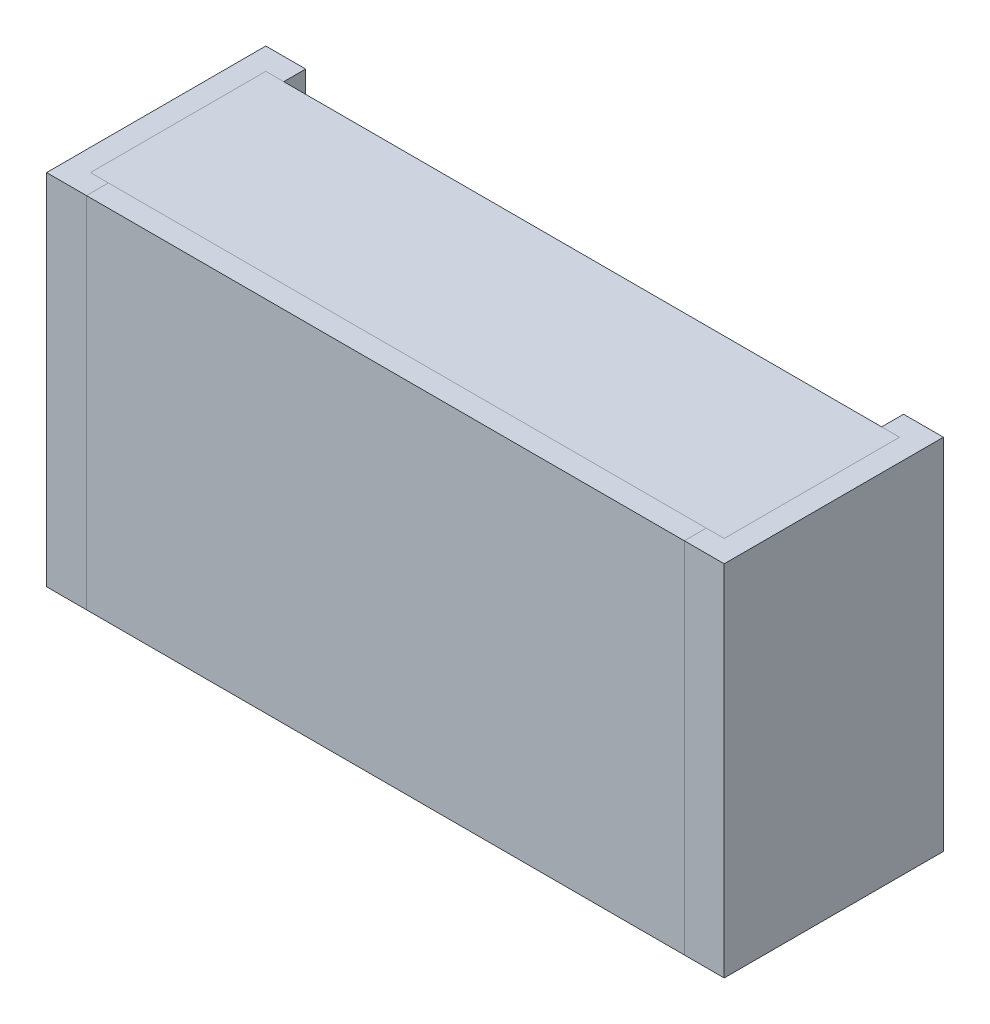
ISO-10303-21;
HEADER;
FILE_DESCRIPTION(('STEP AP214'),'2;1');
FILE_NAME('part.step','',(''),(''),'','','');
FILE_SCHEMA(('AUTOMOTIVE_DESIGN { 1 0 10303 214 1 1 1 1 }'));
ENDSEC;
DATA;
#1=APPLICATION_CONTEXT('core data for automotive mechanical design processes');
#2=APPLICATION_PROTOCOL_DEFINITION('international standard','automotive_design',2000,#1);
#3=PRODUCT_CONTEXT('',#1,'mechanical');
#4=PRODUCT('Part','Part','',(#3));
#5=PRODUCT_RELATED_PRODUCT_CATEGORY('part','',(#4));
#6=PRODUCT_DEFINITION_FORMATION('','',#4);
#7=PRODUCT_DEFINITION_CONTEXT('part definition',#1,'design');
#8=PRODUCT_DEFINITION('design','',#6,#7);
#9=PRODUCT_DEFINITION_SHAPE('','',#8);
#10=(LENGTH_UNIT() NAMED_UNIT(*) SI_UNIT(.MILLI.,.METRE.));
#11=(NAMED_UNIT(*) PLANE_ANGLE_UNIT() SI_UNIT($,.RADIAN.));
#12=(NAMED_UNIT(*) SI_UNIT($,.STERADIAN.) SOLID_ANGLE_UNIT());
#13=UNCERTAINTY_MEASURE_WITH_UNIT(LENGTH_MEASURE(1.E-05),#10,'distance_accuracy_value','');
#14=(GEOMETRIC_REPRESENTATION_CONTEXT(3) GLOBAL_UNCERTAINTY_ASSIGNED_CONTEXT((#13)) GLOBAL_UNIT_ASSIGNED_CONTEXT((#10,
#11,#12)) REPRESENTATION_CONTEXT('',''));
#15=CARTESIAN_POINT('',(0.,0.,0.));
#16=DIRECTION('',(0.,0.,1.));
#17=DIRECTION('',(1.,0.,0.));
#18=AXIS2_PLACEMENT_3D('',#15,#16,#17);
#19=CARTESIAN_POINT('',(-0.79491872,-0.44991872,0.055));
#20=DIRECTION('',(1.,0.,0.));
#21=DIRECTION('',(0.,0.,1.));
#22=AXIS2_PLACEMENT_3D('',#19,#20,#21);
#23=PLANE('',#22);
#24=DIRECTION('',(0.,1.,0.));
#25=VECTOR('',#24,1.);
#26=CARTESIAN_POINT('',(-0.79491872,-0.44991872,0.495));
#27=LINE('',#26,#25);
#28=CARTESIAN_POINT('',(-0.79491872,-0.44991872,0.495));
#29=VERTEX_POINT('',#28);
#30=CARTESIAN_POINT('',(-0.79491872,0.45008128,0.495));
#31=VERTEX_POINT('',#30);
#32=EDGE_CURVE('P0_E11',#29,#31,#27,.T.);
#33=ORIENTED_EDGE('',*,*,#32,.T.);
#34=DIRECTION('',(0.,0.,1.));
#35=VECTOR('',#34,1.);
#36=CARTESIAN_POINT('',(-0.79491872,0.45008128,0.055));
#37=LINE('',#36,#35);
#38=CARTESIAN_POINT('',(-0.79491872,0.45008128,0.055));
#39=VERTEX_POINT('',#38);
#40=EDGE_CURVE('P0_E24',#39,#31,#37,.T.);
#41=ORIENTED_EDGE('',*,*,#40,.F.);
#42=DIRECTION('',(0.,1.,0.));
#43=VECTOR('',#42,1.);
#44=CARTESIAN_POINT('',(-0.79491872,-0.44991872,0.055));
#45=LINE('',#44,#43);
#46=CARTESIAN_POINT('',(-0.79491872,-0.44991872,0.055));
#47=VERTEX_POINT('',#46);
#48=EDGE_CURVE('P0_E86',#47,#39,#45,.T.);
#49=ORIENTED_EDGE('',*,*,#48,.F.);
#50=DIRECTION('',(0.,0.,1.));
#51=VECTOR('',#50,1.);
#52=CARTESIAN_POINT('',(-0.79491872,-0.44991872,0.055));
#53=LINE('',#52,#51);
#54=EDGE_CURVE('P0_E36',#47,#29,#53,.T.);
#55=ORIENTED_EDGE('',*,*,#54,.T.);
#56=EDGE_LOOP('',(#33,#41,#49,#55));
#57=FACE_BOUND('',#56,.T.);
#58=ADVANCED_FACE('P0_F17',(#57),#23,.F.);
#59=CARTESIAN_POINT('',(0.79508128,-0.44991872,0.055));
#60=DIRECTION('',(1.,0.,0.));
#61=DIRECTION('',(0.,0.,1.));
#62=AXIS2_PLACEMENT_3D('',#59,#60,#61);
#63=PLANE('',#62);
#64=DIRECTION('',(0.,0.,1.));
#65=VECTOR('',#64,1.);
#66=CARTESIAN_POINT('',(0.79508128,-0.44991872,0.055));
#67=LINE('',#66,#65);
#68=CARTESIAN_POINT('',(0.79508128,-0.44991872,0.055));
#69=VERTEX_POINT('',#68);
#70=CARTESIAN_POINT('',(0.79508128,-0.44991872,0.495));
#71=VERTEX_POINT('',#70);
#72=EDGE_CURVE('P0_E83',#69,#71,#67,.T.);
#73=ORIENTED_EDGE('',*,*,#72,.F.);
#74=DIRECTION('',(0.,1.,0.));
#75=VECTOR('',#74,1.);
#76=CARTESIAN_POINT('',(0.79508128,-0.44991872,0.055));
#77=LINE('',#76,#75);
#78=CARTESIAN_POINT('',(0.79508128,0.45008128,0.055));
#79=VERTEX_POINT('',#78);
#80=EDGE_CURVE('P0_E63',#69,#79,#77,.T.);
#81=ORIENTED_EDGE('',*,*,#80,.T.);
#82=DIRECTION('',(0.,0.,1.));
#83=VECTOR('',#82,1.);
#84=CARTESIAN_POINT('',(0.79508128,0.45008128,0.055));
#85=LINE('',#84,#83);
#86=CARTESIAN_POINT('',(0.79508128,0.45008128,0.495));
#87=VERTEX_POINT('',#86);
#88=EDGE_CURVE('P0_E57',#79,#87,#85,.T.);
#89=ORIENTED_EDGE('',*,*,#88,.T.);
#90=DIRECTION('',(0.,1.,0.));
#91=VECTOR('',#90,1.);
#92=CARTESIAN_POINT('',(0.79508128,-0.44991872,0.495));
#93=LINE('',#92,#91);
#94=EDGE_CURVE('P0_E60',#71,#87,#93,.T.);
#95=ORIENTED_EDGE('',*,*,#94,.F.);
#96=EDGE_LOOP('',(#73,#81,#89,#95));
#97=FACE_BOUND('',#96,.T.);
#98=ADVANCED_FACE('P0_F59',(#97),#63,.T.);
#99=CARTESIAN_POINT('',(-0.79491872,-0.44991872,0.055));
#100=DIRECTION('',(0.,1.,0.));
#101=DIRECTION('',(0.,0.,1.));
#102=AXIS2_PLACEMENT_3D('',#99,#100,#101);
#103=PLANE('',#102);
#104=ORIENTED_EDGE('',*,*,#72,.T.);
#105=DIRECTION('',(1.,0.,0.));
#106=VECTOR('',#105,1.);
#107=CARTESIAN_POINT('',(-0.79491872,-0.44991872,0.495));
#108=LINE('',#107,#106);
#109=EDGE_CURVE('P0_E71',#29,#71,#108,.T.);
#110=ORIENTED_EDGE('',*,*,#109,.F.);
#111=ORIENTED_EDGE('',*,*,#54,.F.);
#112=DIRECTION('',(1.,0.,0.));
#113=VECTOR('',#112,1.);
#114=CARTESIAN_POINT('',(-0.79491872,-0.44991872,0.055));
#115=LINE('',#114,#113);
#116=EDGE_CURVE('P0_E76',#47,#69,#115,.T.);
#117=ORIENTED_EDGE('',*,*,#116,.T.);
#118=EDGE_LOOP('',(#104,#110,#111,#117));
#119=FACE_BOUND('',#118,.T.);
#120=ADVANCED_FACE('P0_F91',(#119),#103,.F.);
#121=CARTESIAN_POINT('',(-0.79491872,0.45008128,0.055));
#122=DIRECTION('',(0.,1.,0.));
#123=DIRECTION('',(0.,0.,1.));
#124=AXIS2_PLACEMENT_3D('',#121,#122,#123);
#125=PLANE('',#124);
#126=DIRECTION('',(1.,0.,0.));
#127=VECTOR('',#126,1.);
#128=CARTESIAN_POINT('',(-0.79491872,0.45008128,0.055));
#129=LINE('',#128,#127);
#130=EDGE_CURVE('P0_E74',#39,#79,#129,.T.);
#131=ORIENTED_EDGE('',*,*,#130,.F.);
#132=ORIENTED_EDGE('',*,*,#40,.T.);
#133=DIRECTION('',(1.,0.,0.));
#134=VECTOR('',#133,1.);
#135=CARTESIAN_POINT('',(-0.79491872,0.45008128,0.495));
#136=LINE('',#135,#134);
#137=EDGE_CURVE('P0_E69',#31,#87,#136,.T.);
#138=ORIENTED_EDGE('',*,*,#137,.T.);
#139=ORIENTED_EDGE('',*,*,#88,.F.);
#140=EDGE_LOOP('',(#131,#132,#138,#139));
#141=FACE_BOUND('',#140,.T.);
#142=ADVANCED_FACE('P0_F73',(#141),#125,.T.);
#143=CARTESIAN_POINT('',(-0.79491872,-0.44991872,0.055));
#144=DIRECTION('',(0.,0.,1.));
#145=DIRECTION('',(1.,0.,0.));
#146=AXIS2_PLACEMENT_3D('',#143,#144,#145);
#147=PLANE('',#146);
#148=ORIENTED_EDGE('',*,*,#130,.T.);
#149=ORIENTED_EDGE('',*,*,#80,.F.);
#150=ORIENTED_EDGE('',*,*,#116,.F.);
#151=ORIENTED_EDGE('',*,*,#48,.T.);
#152=EDGE_LOOP('',(#148,#149,#150,#151));
#153=FACE_BOUND('',#152,.T.);
#154=ADVANCED_FACE('P0_F89',(#153),#147,.F.);
#155=CARTESIAN_POINT('',(-0.79491872,-0.44991872,0.495));
#156=DIRECTION('',(0.,0.,1.));
#157=DIRECTION('',(1.,0.,0.));
#158=AXIS2_PLACEMENT_3D('',#155,#156,#157);
#159=PLANE('',#158);
#160=ORIENTED_EDGE('',*,*,#32,.F.);
#161=ORIENTED_EDGE('',*,*,#109,.T.);
#162=ORIENTED_EDGE('',*,*,#94,.T.);
#163=ORIENTED_EDGE('',*,*,#137,.F.);
#164=EDGE_LOOP('',(#160,#161,#162,#163));
#165=FACE_BOUND('',#164,.T.);
#166=ADVANCED_FACE('P0_F68',(#165),#159,.T.);
#167=CLOSED_SHELL('',(#58,#98,#120,#142,#154,#166));
#168=MANIFOLD_SOLID_BREP('P0_B1',#167);
#169=CARTESIAN_POINT('',(-0.84991872,-0.44991872,0.));
#170=DIRECTION('',(1.,0.,0.));
#171=DIRECTION('',(0.,0.,1.));
#172=AXIS2_PLACEMENT_3D('',#169,#170,#171);
#173=PLANE('',#172);
#174=DIRECTION('',(0.,1.,0.));
#175=VECTOR('',#174,1.);
#176=CARTESIAN_POINT('',(-0.84991872,-0.44991872,0.55));
#177=LINE('',#176,#175);
#178=CARTESIAN_POINT('',(-0.84991872,-0.44991872,0.55));
#179=VERTEX_POINT('',#178);
#180=CARTESIAN_POINT('',(-0.84991872,0.45008128,0.55));
#181=VERTEX_POINT('',#180);
#182=EDGE_CURVE('P1_E11',#179,#181,#177,.T.);
#183=ORIENTED_EDGE('',*,*,#182,.T.);
#184=DIRECTION('',(0.,0.,1.));
#185=VECTOR('',#184,1.);
#186=CARTESIAN_POINT('',(-0.84991872,0.45008128,0.));
#187=LINE('',#186,#185);
#188=CARTESIAN_POINT('',(-0.84991872,0.45008128,0.));
#189=VERTEX_POINT('',#188);
#190=EDGE_CURVE('P1_E24',#189,#181,#187,.T.);
#191=ORIENTED_EDGE('',*,*,#190,.F.);
#192=DIRECTION('',(0.,1.,0.));
#193=VECTOR('',#192,1.);
#194=CARTESIAN_POINT('',(-0.84991872,-0.44991872,0.));
#195=LINE('',#194,#193);
#196=CARTESIAN_POINT('',(-0.84991872,-0.44991872,0.));
#197=VERTEX_POINT('',#196);
#198=EDGE_CURVE('P1_E139',#197,#189,#195,.T.);
#199=ORIENTED_EDGE('',*,*,#198,.F.);
#200=DIRECTION('',(0.,0.,1.));
#201=VECTOR('',#200,1.);
#202=CARTESIAN_POINT('',(-0.84991872,-0.44991872,0.));
#203=LINE('',#202,#201);
#204=EDGE_CURVE('P1_E36',#197,#179,#203,.T.);
#205=ORIENTED_EDGE('',*,*,#204,.T.);
#206=EDGE_LOOP('',(#183,#191,#199,#205));
#207=FACE_BOUND('',#206,.T.);
#208=ADVANCED_FACE('P1_F17',(#207),#173,.F.);
#209=CARTESIAN_POINT('',(-0.84991872,-0.44991872,0.));
#210=DIRECTION('',(0.,1.,0.));
#211=DIRECTION('',(0.,0.,1.));
#212=AXIS2_PLACEMENT_3D('',#209,#210,#211);
#213=PLANE('',#212);
#214=DIRECTION('',(1.,0.,0.));
#215=VECTOR('',#214,1.);
#216=CARTESIAN_POINT('',(-0.79491872,-0.44991872,0.055));
#217=LINE('',#216,#215);
#218=CARTESIAN_POINT('',(-0.79491872,-0.44991872,0.055));
#219=VERTEX_POINT('',#218);
#220=CARTESIAN_POINT('',(-0.74991872,-0.44991872,0.055));
#221=VERTEX_POINT('',#220);
#222=EDGE_CURVE('P1_E136',#219,#221,#217,.T.);
#223=ORIENTED_EDGE('',*,*,#222,.F.);
#224=DIRECTION('',(0.,0.,1.));
#225=VECTOR('',#224,1.);
#226=CARTESIAN_POINT('',(-0.79491872,-0.44991872,0.055));
#227=LINE('',#226,#225);
#228=CARTESIAN_POINT('',(-0.79491872,-0.44991872,0.495));
#229=VERTEX_POINT('',#228);
#230=EDGE_CURVE('P1_E87',#219,#229,#227,.T.);
#231=ORIENTED_EDGE('',*,*,#230,.T.);
#232=DIRECTION('',(1.,0.,0.));
#233=VECTOR('',#232,1.);
#234=CARTESIAN_POINT('',(-0.79491872,-0.44991872,0.495));
#235=LINE('',#234,#233);
#236=CARTESIAN_POINT('',(-0.74991872,-0.44991872,0.495));
#237=VERTEX_POINT('',#236);
#238=EDGE_CURVE('P1_E132',#229,#237,#235,.T.);
#239=ORIENTED_EDGE('',*,*,#238,.T.);
#240=DIRECTION('',(0.,0.,1.));
#241=VECTOR('',#240,1.);
#242=CARTESIAN_POINT('',(-0.74991872,-0.44991872,0.));
#243=LINE('',#242,#241);
#244=CARTESIAN_POINT('',(-0.74991872,-0.44991872,0.55));
#245=VERTEX_POINT('',#244);
#246=EDGE_CURVE('P1_E129',#237,#245,#243,.T.);
#247=ORIENTED_EDGE('',*,*,#246,.T.);
#248=DIRECTION('',(1.,0.,0.));
#249=VECTOR('',#248,1.);
#250=CARTESIAN_POINT('',(-0.84991872,-0.44991872,0.55));
#251=LINE('',#250,#249);
#252=EDGE_CURVE('P1_E127',#179,#245,#251,.T.);
#253=ORIENTED_EDGE('',*,*,#252,.F.);
#254=ORIENTED_EDGE('',*,*,#204,.F.);
#255=DIRECTION('',(1.,0.,0.));
#256=VECTOR('',#255,1.);
#257=CARTESIAN_POINT('',(-0.84991872,-0.44991872,0.));
#258=LINE('',#257,#256);
#259=CARTESIAN_POINT('',(-0.74991872,-0.44991872,0.));
#260=VERTEX_POINT('',#259);
#261=EDGE_CURVE('P1_E124',#197,#260,#258,.T.);
#262=ORIENTED_EDGE('',*,*,#261,.T.);
#263=DIRECTION('',(0.,0.,1.));
#264=VECTOR('',#263,1.);
#265=CARTESIAN_POINT('',(-0.74991872,-0.44991872,0.));
#266=LINE('',#265,#264);
#267=EDGE_CURVE('P1_E122',#260,#221,#266,.T.);
#268=ORIENTED_EDGE('',*,*,#267,.T.);
#269=EDGE_LOOP('',(#223,#231,#239,#247,#253,#254,#262,#268));
#270=FACE_BOUND('',#269,.T.);
#271=ADVANCED_FACE('P1_F161',(#270),#213,.F.);
#272=CARTESIAN_POINT('',(-0.84991872,-0.44991872,0.55));
#273=DIRECTION('',(0.,0.,1.));
#274=DIRECTION('',(1.,0.,0.));
#275=AXIS2_PLACEMENT_3D('',#272,#273,#274);
#276=PLANE('',#275);
#277=ORIENTED_EDGE('',*,*,#182,.F.);
#278=ORIENTED_EDGE('',*,*,#252,.T.);
#279=DIRECTION('',(0.,1.,0.));
#280=VECTOR('',#279,1.);
#281=CARTESIAN_POINT('',(-0.74991872,-0.44991872,0.55));
#282=LINE('',#281,#280);
#283=CARTESIAN_POINT('',(-0.74991872,0.45008128,0.55));
#284=VERTEX_POINT('',#283);
#285=EDGE_CURVE('P1_E119',#245,#284,#282,.T.);
#286=ORIENTED_EDGE('',*,*,#285,.T.);
#287=DIRECTION('',(1.,0.,0.));
#288=VECTOR('',#287,1.);
#289=CARTESIAN_POINT('',(-0.84991872,0.45008128,0.55));
#290=LINE('',#289,#288);
#291=EDGE_CURVE('P1_E117',#181,#284,#290,.T.);
#292=ORIENTED_EDGE('',*,*,#291,.F.);
#293=EDGE_LOOP('',(#277,#278,#286,#292));
#294=FACE_BOUND('',#293,.T.);
#295=ADVANCED_FACE('P1_F163',(#294),#276,.T.);
#296=CARTESIAN_POINT('',(-0.84991872,0.45008128,0.));
#297=DIRECTION('',(0.,1.,0.));
#298=DIRECTION('',(0.,0.,1.));
#299=AXIS2_PLACEMENT_3D('',#296,#297,#298);
#300=PLANE('',#299);
#301=DIRECTION('',(0.,0.,1.));
#302=VECTOR('',#301,1.);
#303=CARTESIAN_POINT('',(-0.74991872,0.45008128,0.));
#304=LINE('',#303,#302);
#305=CARTESIAN_POINT('',(-0.74991872,0.45008128,0.));
#306=VERTEX_POINT('',#305);
#307=CARTESIAN_POINT('',(-0.74991872,0.45008128,0.055));
#308=VERTEX_POINT('',#307);
#309=EDGE_CURVE('P1_E115',#306,#308,#304,.T.);
#310=ORIENTED_EDGE('',*,*,#309,.F.);
#311=DIRECTION('',(1.,0.,0.));
#312=VECTOR('',#311,1.);
#313=CARTESIAN_POINT('',(-0.84991872,0.45008128,0.));
#314=LINE('',#313,#312);
#315=EDGE_CURVE('P1_E112',#189,#306,#314,.T.);
#316=ORIENTED_EDGE('',*,*,#315,.F.);
#317=ORIENTED_EDGE('',*,*,#190,.T.);
#318=ORIENTED_EDGE('',*,*,#291,.T.);
#319=DIRECTION('',(0.,0.,1.));
#320=VECTOR('',#319,1.);
#321=CARTESIAN_POINT('',(-0.74991872,0.45008128,0.));
#322=LINE('',#321,#320);
#323=CARTESIAN_POINT('',(-0.74991872,0.45008128,0.495));
#324=VERTEX_POINT('',#323);
#325=EDGE_CURVE('P1_E106',#324,#284,#322,.T.);
#326=ORIENTED_EDGE('',*,*,#325,.F.);
#327=DIRECTION('',(1.,0.,0.));
#328=VECTOR('',#327,1.);
#329=CARTESIAN_POINT('',(-0.79491872,0.45008128,0.495));
#330=LINE('',#329,#328);
#331=CARTESIAN_POINT('',(-0.79491872,0.45008128,0.495));
#332=VERTEX_POINT('',#331);
#333=EDGE_CURVE('P1_E104',#332,#324,#330,.T.);
#334=ORIENTED_EDGE('',*,*,#333,.F.);
#335=DIRECTION('',(0.,0.,1.));
#336=VECTOR('',#335,1.);
#337=CARTESIAN_POINT('',(-0.79491872,0.45008128,0.055));
#338=LINE('',#337,#336);
#339=CARTESIAN_POINT('',(-0.79491872,0.45008128,0.055));
#340=VERTEX_POINT('',#339);
#341=EDGE_CURVE('P1_E84',#340,#332,#338,.T.);
#342=ORIENTED_EDGE('',*,*,#341,.F.);
#343=DIRECTION('',(1.,0.,0.));
#344=VECTOR('',#343,1.);
#345=CARTESIAN_POINT('',(-0.79491872,0.45008128,0.055));
#346=LINE('',#345,#344);
#347=EDGE_CURVE('P1_E95',#340,#308,#346,.T.);
#348=ORIENTED_EDGE('',*,*,#347,.T.);
#349=EDGE_LOOP('',(#310,#316,#317,#318,#326,#334,#342,#348));
#350=FACE_BOUND('',#349,.T.);
#351=ADVANCED_FACE('P1_F102',(#350),#300,.T.);
#352=CARTESIAN_POINT('',(-0.84991872,-0.44991872,0.));
#353=DIRECTION('',(0.,0.,1.));
#354=DIRECTION('',(1.,0.,0.));
#355=AXIS2_PLACEMENT_3D('',#352,#353,#354);
#356=PLANE('',#355);
#357=ORIENTED_EDGE('',*,*,#315,.T.);
#358=DIRECTION('',(0.,1.,0.));
#359=VECTOR('',#358,1.);
#360=CARTESIAN_POINT('',(-0.74991872,-0.44991872,0.));
#361=LINE('',#360,#359);
#362=EDGE_CURVE('P1_E100',#260,#306,#361,.T.);
#363=ORIENTED_EDGE('',*,*,#362,.F.);
#364=ORIENTED_EDGE('',*,*,#261,.F.);
#365=ORIENTED_EDGE('',*,*,#198,.T.);
#366=EDGE_LOOP('',(#357,#363,#364,#365));
#367=FACE_BOUND('',#366,.T.);
#368=ADVANCED_FACE('P1_F142',(#367),#356,.F.);
#369=CARTESIAN_POINT('',(-0.74991872,-0.44991872,0.));
#370=DIRECTION('',(1.,0.,0.));
#371=DIRECTION('',(0.,0.,1.));
#372=AXIS2_PLACEMENT_3D('',#369,#370,#371);
#373=PLANE('',#372);
#374=ORIENTED_EDGE('',*,*,#267,.F.);
#375=ORIENTED_EDGE('',*,*,#362,.T.);
#376=ORIENTED_EDGE('',*,*,#309,.T.);
#377=DIRECTION('',(0.,-1.,0.));
#378=VECTOR('',#377,1.);
#379=CARTESIAN_POINT('',(-0.74991872,-0.44991872,0.055));
#380=LINE('',#379,#378);
#381=EDGE_CURVE('P1_E91',#308,#221,#380,.T.);
#382=ORIENTED_EDGE('',*,*,#381,.T.);
#383=EDGE_LOOP('',(#374,#375,#376,#382));
#384=FACE_BOUND('',#383,.T.);
#385=ADVANCED_FACE('P1_F146',(#384),#373,.T.);
#386=CARTESIAN_POINT('',(-0.79491872,-0.44991872,0.055));
#387=DIRECTION('',(0.,0.,1.));
#388=DIRECTION('',(1.,0.,0.));
#389=AXIS2_PLACEMENT_3D('',#386,#387,#388);
#390=PLANE('',#389);
#391=ORIENTED_EDGE('',*,*,#347,.F.);
#392=DIRECTION('',(0.,1.,0.));
#393=VECTOR('',#392,1.);
#394=CARTESIAN_POINT('',(-0.79491872,-0.44991872,0.055));
#395=LINE('',#394,#393);
#396=EDGE_CURVE('P1_E80',#219,#340,#395,.T.);
#397=ORIENTED_EDGE('',*,*,#396,.F.);
#398=ORIENTED_EDGE('',*,*,#222,.T.);
#399=ORIENTED_EDGE('',*,*,#381,.F.);
#400=EDGE_LOOP('',(#391,#397,#398,#399));
#401=FACE_BOUND('',#400,.T.);
#402=ADVANCED_FACE('P1_F96',(#401),#390,.T.);
#403=CARTESIAN_POINT('',(-0.79491872,-0.44991872,0.055));
#404=DIRECTION('',(1.,0.,0.));
#405=DIRECTION('',(0.,0.,1.));
#406=AXIS2_PLACEMENT_3D('',#403,#404,#405);
#407=PLANE('',#406);
#408=ORIENTED_EDGE('',*,*,#230,.F.);
#409=ORIENTED_EDGE('',*,*,#396,.T.);
#410=ORIENTED_EDGE('',*,*,#341,.T.);
#411=DIRECTION('',(0.,1.,0.));
#412=VECTOR('',#411,1.);
#413=CARTESIAN_POINT('',(-0.79491872,-0.44991872,0.495));
#414=LINE('',#413,#412);
#415=EDGE_CURVE('P1_E92',#229,#332,#414,.T.);
#416=ORIENTED_EDGE('',*,*,#415,.F.);
#417=EDGE_LOOP('',(#408,#409,#410,#416));
#418=FACE_BOUND('',#417,.T.);
#419=ADVANCED_FACE('P1_F82',(#418),#407,.T.);
#420=CARTESIAN_POINT('',(-0.79491872,-0.44991872,0.495));
#421=DIRECTION('',(0.,0.,1.));
#422=DIRECTION('',(1.,0.,0.));
#423=AXIS2_PLACEMENT_3D('',#420,#421,#422);
#424=PLANE('',#423);
#425=DIRECTION('',(0.,-1.,0.));
#426=VECTOR('',#425,1.);
#427=CARTESIAN_POINT('',(-0.74991872,-0.44991872,0.495));
#428=LINE('',#427,#426);
#429=EDGE_CURVE('P1_E150',#324,#237,#428,.T.);
#430=ORIENTED_EDGE('',*,*,#429,.T.);
#431=ORIENTED_EDGE('',*,*,#238,.F.);
#432=ORIENTED_EDGE('',*,*,#415,.T.);
#433=ORIENTED_EDGE('',*,*,#333,.T.);
#434=EDGE_LOOP('',(#430,#431,#432,#433));
#435=FACE_BOUND('',#434,.T.);
#436=ADVANCED_FACE('P1_F155',(#435),#424,.F.);
#437=CARTESIAN_POINT('',(-0.74991872,-0.44991872,0.));
#438=DIRECTION('',(1.,0.,0.));
#439=DIRECTION('',(0.,0.,1.));
#440=AXIS2_PLACEMENT_3D('',#437,#438,#439);
#441=PLANE('',#440);
#442=ORIENTED_EDGE('',*,*,#246,.F.);
#443=ORIENTED_EDGE('',*,*,#429,.F.);
#444=ORIENTED_EDGE('',*,*,#325,.T.);
#445=ORIENTED_EDGE('',*,*,#285,.F.);
#446=EDGE_LOOP('',(#442,#443,#444,#445));
#447=FACE_BOUND('',#446,.T.);
#448=ADVANCED_FACE('P1_F158',(#447),#441,.T.);
#449=CLOSED_SHELL('',(#208,#271,#295,#351,#368,#385,#402,#419,#436,#448));
#450=MANIFOLD_SOLID_BREP('P1_B1',#449);
#451=CARTESIAN_POINT('',(0.85008128,0.45008128,0.));
#452=DIRECTION('',(-1.,0.,0.));
#453=DIRECTION('',(0.,0.,1.));
#454=AXIS2_PLACEMENT_3D('',#451,#452,#453);
#455=PLANE('',#454);
#456=DIRECTION('',(0.,-1.,0.));
#457=VECTOR('',#456,1.);
#458=CARTESIAN_POINT('',(0.85008128,0.45008128,0.55));
#459=LINE('',#458,#457);
#460=CARTESIAN_POINT('',(0.85008128,0.45008128,0.55));
#461=VERTEX_POINT('',#460);
#462=CARTESIAN_POINT('',(0.85008128,-0.44991872,0.55));
#463=VERTEX_POINT('',#462);
#464=EDGE_CURVE('P2_E11',#461,#463,#459,.T.);
#465=ORIENTED_EDGE('',*,*,#464,.T.);
#466=DIRECTION('',(0.,0.,1.));
#467=VECTOR('',#466,1.);
#468=CARTESIAN_POINT('',(0.85008128,-0.44991872,0.));
#469=LINE('',#468,#467);
#470=CARTESIAN_POINT('',(0.85008128,-0.44991872,0.));
#471=VERTEX_POINT('',#470);
#472=EDGE_CURVE('P2_E24',#471,#463,#469,.T.);
#473=ORIENTED_EDGE('',*,*,#472,.F.);
#474=DIRECTION('',(0.,-1.,0.));
#475=VECTOR('',#474,1.);
#476=CARTESIAN_POINT('',(0.85008128,0.45008128,0.));
#477=LINE('',#476,#475);
#478=CARTESIAN_POINT('',(0.85008128,0.45008128,0.));
#479=VERTEX_POINT('',#478);
#480=EDGE_CURVE('P2_E137',#479,#471,#477,.T.);
#481=ORIENTED_EDGE('',*,*,#480,.F.);
#482=DIRECTION('',(0.,0.,1.));
#483=VECTOR('',#482,1.);
#484=CARTESIAN_POINT('',(0.85008128,0.45008128,0.));
#485=LINE('',#484,#483);
#486=EDGE_CURVE('P2_E37',#479,#461,#485,.T.);
#487=ORIENTED_EDGE('',*,*,#486,.T.);
#488=EDGE_LOOP('',(#465,#473,#481,#487));
#489=FACE_BOUND('',#488,.T.);
#490=ADVANCED_FACE('P2_F17',(#489),#455,.F.);
#491=CARTESIAN_POINT('',(0.85008128,0.45008128,0.));
#492=DIRECTION('',(0.,-1.,0.));
#493=DIRECTION('',(0.,0.,1.));
#494=AXIS2_PLACEMENT_3D('',#491,#492,#493);
#495=PLANE('',#494);
#496=DIRECTION('',(-1.,0.,0.));
#497=VECTOR('',#496,1.);
#498=CARTESIAN_POINT('',(0.79508128,0.45008128,0.055));
#499=LINE('',#498,#497);
#500=CARTESIAN_POINT('',(0.79508128,0.45008128,0.055));
#501=VERTEX_POINT('',#500);
#502=CARTESIAN_POINT('',(0.75008128,0.45008128,0.055));
#503=VERTEX_POINT('',#502);
#504=EDGE_CURVE('P2_E134',#501,#503,#499,.T.);
#505=ORIENTED_EDGE('',*,*,#504,.F.);
#506=DIRECTION('',(0.,0.,1.));
#507=VECTOR('',#506,1.);
#508=CARTESIAN_POINT('',(0.79508128,0.45008128,0.055));
#509=LINE('',#508,#507);
#510=CARTESIAN_POINT('',(0.79508128,0.45008128,0.495));
#511=VERTEX_POINT('',#510);
#512=EDGE_CURVE('P2_E99',#501,#511,#509,.T.);
#513=ORIENTED_EDGE('',*,*,#512,.T.);
#514=DIRECTION('',(-1.,0.,0.));
#515=VECTOR('',#514,1.);
#516=CARTESIAN_POINT('',(0.79508128,0.45008128,0.495));
#517=LINE('',#516,#515);
#518=CARTESIAN_POINT('',(0.75008128,0.45008128,0.495));
#519=VERTEX_POINT('',#518);
#520=EDGE_CURVE('P2_E131',#511,#519,#517,.T.);
#521=ORIENTED_EDGE('',*,*,#520,.T.);
#522=DIRECTION('',(0.,0.,1.));
#523=VECTOR('',#522,1.);
#524=CARTESIAN_POINT('',(0.75008128,0.45008128,0.));
#525=LINE('',#524,#523);
#526=CARTESIAN_POINT('',(0.75008128,0.45008128,0.55));
#527=VERTEX_POINT('',#526);
#528=EDGE_CURVE('P2_E128',#519,#527,#525,.T.);
#529=ORIENTED_EDGE('',*,*,#528,.T.);
#530=DIRECTION('',(-1.,0.,0.));
#531=VECTOR('',#530,1.);
#532=CARTESIAN_POINT('',(0.85008128,0.45008128,0.55));
#533=LINE('',#532,#531);
#534=EDGE_CURVE('P2_E126',#461,#527,#533,.T.);
#535=ORIENTED_EDGE('',*,*,#534,.F.);
#536=ORIENTED_EDGE('',*,*,#486,.F.);
#537=DIRECTION('',(-1.,0.,0.));
#538=VECTOR('',#537,1.);
#539=CARTESIAN_POINT('',(0.85008128,0.45008128,0.));
#540=LINE('',#539,#538);
#541=CARTESIAN_POINT('',(0.75008128,0.45008128,0.));
#542=VERTEX_POINT('',#541);
#543=EDGE_CURVE('P2_E123',#479,#542,#540,.T.);
#544=ORIENTED_EDGE('',*,*,#543,.T.);
#545=DIRECTION('',(0.,0.,1.));
#546=VECTOR('',#545,1.);
#547=CARTESIAN_POINT('',(0.75008128,0.45008128,0.));
#548=LINE('',#547,#546);
#549=EDGE_CURVE('P2_E120',#542,#503,#548,.T.);
#550=ORIENTED_EDGE('',*,*,#549,.T.);
#551=EDGE_LOOP('',(#505,#513,#521,#529,#535,#536,#544,#550));
#552=FACE_BOUND('',#551,.T.);
#553=ADVANCED_FACE('P2_F146',(#552),#495,.F.);
#554=CARTESIAN_POINT('',(0.85008128,0.45008128,0.55));
#555=DIRECTION('',(0.,0.,1.));
#556=DIRECTION('',(-1.,0.,0.));
#557=AXIS2_PLACEMENT_3D('',#554,#555,#556);
#558=PLANE('',#557);
#559=ORIENTED_EDGE('',*,*,#464,.F.);
#560=ORIENTED_EDGE('',*,*,#534,.T.);
#561=DIRECTION('',(0.,-1.,0.));
#562=VECTOR('',#561,1.);
#563=CARTESIAN_POINT('',(0.75008128,0.45008128,0.55));
#564=LINE('',#563,#562);
#565=CARTESIAN_POINT('',(0.75008128,-0.44991872,0.55));
#566=VERTEX_POINT('',#565);
#567=EDGE_CURVE('P2_E118',#527,#566,#564,.T.);
#568=ORIENTED_EDGE('',*,*,#567,.T.);
#569=DIRECTION('',(-1.,0.,0.));
#570=VECTOR('',#569,1.);
#571=CARTESIAN_POINT('',(0.85008128,-0.44991872,0.55));
#572=LINE('',#571,#570);
#573=EDGE_CURVE('P2_E31',#463,#566,#572,.T.);
#574=ORIENTED_EDGE('',*,*,#573,.F.);
#575=EDGE_LOOP('',(#559,#560,#568,#574));
#576=FACE_BOUND('',#575,.T.);
#577=ADVANCED_FACE('P2_F142',(#576),#558,.T.);
#578=CARTESIAN_POINT('',(0.85008128,-0.44991872,0.));
#579=DIRECTION('',(0.,-1.,0.));
#580=DIRECTION('',(0.,0.,1.));
#581=AXIS2_PLACEMENT_3D('',#578,#579,#580);
#582=PLANE('',#581);
#583=DIRECTION('',(0.,0.,1.));
#584=VECTOR('',#583,1.);
#585=CARTESIAN_POINT('',(0.75008128,-0.44991872,0.));
#586=LINE('',#585,#584);
#587=CARTESIAN_POINT('',(0.75008128,-0.44991872,0.));
#588=VERTEX_POINT('',#587);
#589=CARTESIAN_POINT('',(0.75008128,-0.44991872,0.055));
#590=VERTEX_POINT('',#589);
#591=EDGE_CURVE('P2_E115',#588,#590,#586,.T.);
#592=ORIENTED_EDGE('',*,*,#591,.F.);
#593=DIRECTION('',(-1.,0.,0.));
#594=VECTOR('',#593,1.);
#595=CARTESIAN_POINT('',(0.85008128,-0.44991872,0.));
#596=LINE('',#595,#594);
#597=EDGE_CURVE('P2_E112',#471,#588,#596,.T.);
#598=ORIENTED_EDGE('',*,*,#597,.F.);
#599=ORIENTED_EDGE('',*,*,#472,.T.);
#600=ORIENTED_EDGE('',*,*,#573,.T.);
#601=DIRECTION('',(0.,0.,1.));
#602=VECTOR('',#601,1.);
#603=CARTESIAN_POINT('',(0.75008128,-0.44991872,0.));
#604=LINE('',#603,#602);
#605=CARTESIAN_POINT('',(0.75008128,-0.44991872,0.495));
#606=VERTEX_POINT('',#605);
#607=EDGE_CURVE('P2_E106',#606,#566,#604,.T.);
#608=ORIENTED_EDGE('',*,*,#607,.F.);
#609=DIRECTION('',(-1.,0.,0.));
#610=VECTOR('',#609,1.);
#611=CARTESIAN_POINT('',(0.79508128,-0.44991872,0.495));
#612=LINE('',#611,#610);
#613=CARTESIAN_POINT('',(0.79508128,-0.44991872,0.495));
#614=VERTEX_POINT('',#613);
#615=EDGE_CURVE('P2_E104',#614,#606,#612,.T.);
#616=ORIENTED_EDGE('',*,*,#615,.F.);
#617=DIRECTION('',(0.,0.,1.));
#618=VECTOR('',#617,1.);
#619=CARTESIAN_POINT('',(0.79508128,-0.44991872,0.055));
#620=LINE('',#619,#618);
#621=CARTESIAN_POINT('',(0.79508128,-0.44991872,0.055));
#622=VERTEX_POINT('',#621);
#623=EDGE_CURVE('P2_E91',#622,#614,#620,.T.);
#624=ORIENTED_EDGE('',*,*,#623,.F.);
#625=DIRECTION('',(-1.,0.,0.));
#626=VECTOR('',#625,1.);
#627=CARTESIAN_POINT('',(0.79508128,-0.44991872,0.055));
#628=LINE('',#627,#626);
#629=EDGE_CURVE('P2_E82',#622,#590,#628,.T.);
#630=ORIENTED_EDGE('',*,*,#629,.T.);
#631=EDGE_LOOP('',(#592,#598,#599,#600,#608,#616,#624,#630));
#632=FACE_BOUND('',#631,.T.);
#633=ADVANCED_FACE('P2_F102',(#632),#582,.T.);
#634=CARTESIAN_POINT('',(0.85008128,0.45008128,0.));
#635=DIRECTION('',(0.,0.,1.));
#636=DIRECTION('',(-1.,0.,0.));
#637=AXIS2_PLACEMENT_3D('',#634,#635,#636);
#638=PLANE('',#637);
#639=ORIENTED_EDGE('',*,*,#597,.T.);
#640=DIRECTION('',(0.,-1.,0.));
#641=VECTOR('',#640,1.);
#642=CARTESIAN_POINT('',(0.75008128,0.45008128,0.));
#643=LINE('',#642,#641);
#644=EDGE_CURVE('P2_E92',#542,#588,#643,.T.);
#645=ORIENTED_EDGE('',*,*,#644,.F.);
#646=ORIENTED_EDGE('',*,*,#543,.F.);
#647=ORIENTED_EDGE('',*,*,#480,.T.);
#648=EDGE_LOOP('',(#639,#645,#646,#647));
#649=FACE_BOUND('',#648,.T.);
#650=ADVANCED_FACE('P2_F163',(#649),#638,.F.);
#651=CARTESIAN_POINT('',(0.75008128,0.45008128,0.));
#652=DIRECTION('',(-1.,0.,0.));
#653=DIRECTION('',(0.,0.,1.));
#654=AXIS2_PLACEMENT_3D('',#651,#652,#653);
#655=PLANE('',#654);
#656=ORIENTED_EDGE('',*,*,#549,.F.);
#657=ORIENTED_EDGE('',*,*,#644,.T.);
#658=ORIENTED_EDGE('',*,*,#591,.T.);
#659=DIRECTION('',(0.,1.,0.));
#660=VECTOR('',#659,1.);
#661=CARTESIAN_POINT('',(0.75008128,0.45008128,0.055));
#662=LINE('',#661,#660);
#663=EDGE_CURVE('P2_E88',#590,#503,#662,.T.);
#664=ORIENTED_EDGE('',*,*,#663,.T.);
#665=EDGE_LOOP('',(#656,#657,#658,#664));
#666=FACE_BOUND('',#665,.T.);
#667=ADVANCED_FACE('P2_F161',(#666),#655,.T.);
#668=CARTESIAN_POINT('',(0.79508128,0.45008128,0.055));
#669=DIRECTION('',(0.,0.,1.));
#670=DIRECTION('',(-1.,0.,0.));
#671=AXIS2_PLACEMENT_3D('',#668,#669,#670);
#672=PLANE('',#671);
#673=ORIENTED_EDGE('',*,*,#629,.F.);
#674=DIRECTION('',(0.,-1.,0.));
#675=VECTOR('',#674,1.);
#676=CARTESIAN_POINT('',(0.79508128,0.45008128,0.055));
#677=LINE('',#676,#675);
#678=EDGE_CURVE('P2_E85',#501,#622,#677,.T.);
#679=ORIENTED_EDGE('',*,*,#678,.F.);
#680=ORIENTED_EDGE('',*,*,#504,.T.);
#681=ORIENTED_EDGE('',*,*,#663,.F.);
#682=EDGE_LOOP('',(#673,#679,#680,#681));
#683=FACE_BOUND('',#682,.T.);
#684=ADVANCED_FACE('P2_F84',(#683),#672,.T.);
#685=CARTESIAN_POINT('',(0.79508128,0.45008128,0.055));
#686=DIRECTION('',(-1.,0.,0.));
#687=DIRECTION('',(0.,0.,1.));
#688=AXIS2_PLACEMENT_3D('',#685,#686,#687);
#689=PLANE('',#688);
#690=ORIENTED_EDGE('',*,*,#512,.F.);
#691=ORIENTED_EDGE('',*,*,#678,.T.);
#692=ORIENTED_EDGE('',*,*,#623,.T.);
#693=DIRECTION('',(0.,-1.,0.));
#694=VECTOR('',#693,1.);
#695=CARTESIAN_POINT('',(0.79508128,0.45008128,0.495));
#696=LINE('',#695,#694);
#697=EDGE_CURVE('P2_E100',#511,#614,#696,.T.);
#698=ORIENTED_EDGE('',*,*,#697,.F.);
#699=EDGE_LOOP('',(#690,#691,#692,#698));
#700=FACE_BOUND('',#699,.T.);
#701=ADVANCED_FACE('P2_F96',(#700),#689,.T.);
#702=CARTESIAN_POINT('',(0.79508128,0.45008128,0.495));
#703=DIRECTION('',(0.,0.,1.));
#704=DIRECTION('',(-1.,0.,0.));
#705=AXIS2_PLACEMENT_3D('',#702,#703,#704);
#706=PLANE('',#705);
#707=DIRECTION('',(0.,1.,0.));
#708=VECTOR('',#707,1.);
#709=CARTESIAN_POINT('',(0.75008128,0.45008128,0.495));
#710=LINE('',#709,#708);
#711=EDGE_CURVE('P2_E152',#606,#519,#710,.T.);
#712=ORIENTED_EDGE('',*,*,#711,.T.);
#713=ORIENTED_EDGE('',*,*,#520,.F.);
#714=ORIENTED_EDGE('',*,*,#697,.T.);
#715=ORIENTED_EDGE('',*,*,#615,.T.);
#716=EDGE_LOOP('',(#712,#713,#714,#715));
#717=FACE_BOUND('',#716,.T.);
#718=ADVANCED_FACE('P2_F154',(#717),#706,.F.);
#719=CARTESIAN_POINT('',(0.75008128,0.45008128,0.));
#720=DIRECTION('',(-1.,0.,0.));
#721=DIRECTION('',(0.,0.,1.));
#722=AXIS2_PLACEMENT_3D('',#719,#720,#721);
#723=PLANE('',#722);
#724=ORIENTED_EDGE('',*,*,#528,.F.);
#725=ORIENTED_EDGE('',*,*,#711,.F.);
#726=ORIENTED_EDGE('',*,*,#607,.T.);
#727=ORIENTED_EDGE('',*,*,#567,.F.);
#728=EDGE_LOOP('',(#724,#725,#726,#727));
#729=FACE_BOUND('',#728,.T.);
#730=ADVANCED_FACE('P2_F151',(#729),#723,.T.);
#731=CLOSED_SHELL('',(#490,#553,#577,#633,#650,#667,#684,#701,#718,#730));
#732=MANIFOLD_SOLID_BREP('P2_B1',#731);
#733=CARTESIAN_POINT('',(-0.74991872,-0.44991872,0.495));
#734=DIRECTION('',(1.,0.,0.));
#735=DIRECTION('',(0.,0.,1.));
#736=AXIS2_PLACEMENT_3D('',#733,#734,#735);
#737=PLANE('',#736);
#738=DIRECTION('',(0.,1.,0.));
#739=VECTOR('',#738,1.);
#740=CARTESIAN_POINT('',(-0.74991872,-0.44991872,0.55));
#741=LINE('',#740,#739);
#742=CARTESIAN_POINT('',(-0.74991872,-0.44991872,0.55));
#743=VERTEX_POINT('',#742);
#744=CARTESIAN_POINT('',(-0.74991872,0.45008128,0.55));
#745=VERTEX_POINT('',#744);
#746=EDGE_CURVE('P3_E10',#743,#745,#741,.T.);
#747=ORIENTED_EDGE('',*,*,#746,.T.);
#748=DIRECTION('',(0.,0.,1.));
#749=VECTOR('',#748,1.);
#750=CARTESIAN_POINT('',(-0.74991872,0.45008128,0.495));
#751=LINE('',#750,#749);
#752=CARTESIAN_POINT('',(-0.74991872,0.45008128,0.495));
#753=VERTEX_POINT('',#752);
#754=EDGE_CURVE('P3_E23',#753,#745,#751,.T.);
#755=ORIENTED_EDGE('',*,*,#754,.F.);
#756=DIRECTION('',(0.,1.,0.));
#757=VECTOR('',#756,1.);
#758=CARTESIAN_POINT('',(-0.74991872,-0.44991872,0.495));
#759=LINE('',#758,#757);
#760=CARTESIAN_POINT('',(-0.74991872,-0.44991872,0.495));
#761=VERTEX_POINT('',#760);
#762=EDGE_CURVE('P3_E85',#761,#753,#759,.T.);
#763=ORIENTED_EDGE('',*,*,#762,.F.);
#764=DIRECTION('',(0.,0.,1.));
#765=VECTOR('',#764,1.);
#766=CARTESIAN_POINT('',(-0.74991872,-0.44991872,0.495));
#767=LINE('',#766,#765);
#768=EDGE_CURVE('P3_E35',#761,#743,#767,.T.);
#769=ORIENTED_EDGE('',*,*,#768,.T.);
#770=EDGE_LOOP('',(#747,#755,#763,#769));
#771=FACE_BOUND('',#770,.T.);
#772=ADVANCED_FACE('P3_F16',(#771),#737,.F.);
#773=CARTESIAN_POINT('',(0.75008128,-0.44991872,0.495));
#774=DIRECTION('',(1.,0.,0.));
#775=DIRECTION('',(0.,0.,1.));
#776=AXIS2_PLACEMENT_3D('',#773,#774,#775);
#777=PLANE('',#776);
#778=DIRECTION('',(0.,0.,1.));
#779=VECTOR('',#778,1.);
#780=CARTESIAN_POINT('',(0.75008128,-0.44991872,0.495));
#781=LINE('',#780,#779);
#782=CARTESIAN_POINT('',(0.75008128,-0.44991872,0.495));
#783=VERTEX_POINT('',#782);
#784=CARTESIAN_POINT('',(0.75008128,-0.44991872,0.55));
#785=VERTEX_POINT('',#784);
#786=EDGE_CURVE('P3_E82',#783,#785,#781,.T.);
#787=ORIENTED_EDGE('',*,*,#786,.F.);
#788=DIRECTION('',(0.,1.,0.));
#789=VECTOR('',#788,1.);
#790=CARTESIAN_POINT('',(0.75008128,-0.44991872,0.495));
#791=LINE('',#790,#789);
#792=CARTESIAN_POINT('',(0.75008128,0.45008128,0.495));
#793=VERTEX_POINT('',#792);
#794=EDGE_CURVE('P3_E61',#783,#793,#791,.T.);
#795=ORIENTED_EDGE('',*,*,#794,.T.);
#796=DIRECTION('',(0.,0.,1.));
#797=VECTOR('',#796,1.);
#798=CARTESIAN_POINT('',(0.75008128,0.45008128,0.495));
#799=LINE('',#798,#797);
#800=CARTESIAN_POINT('',(0.75008128,0.45008128,0.55));
#801=VERTEX_POINT('',#800);
#802=EDGE_CURVE('P3_E55',#793,#801,#799,.T.);
#803=ORIENTED_EDGE('',*,*,#802,.T.);
#804=DIRECTION('',(0.,1.,0.));
#805=VECTOR('',#804,1.);
#806=CARTESIAN_POINT('',(0.75008128,-0.44991872,0.55));
#807=LINE('',#806,#805);
#808=EDGE_CURVE('P3_E58',#785,#801,#807,.T.);
#809=ORIENTED_EDGE('',*,*,#808,.F.);
#810=EDGE_LOOP('',(#787,#795,#803,#809));
#811=FACE_BOUND('',#810,.T.);
#812=ADVANCED_FACE('P3_F57',(#811),#777,.T.);
#813=CARTESIAN_POINT('',(-0.74991872,-0.44991872,0.495));
#814=DIRECTION('',(0.,1.,0.));
#815=DIRECTION('',(0.,0.,1.));
#816=AXIS2_PLACEMENT_3D('',#813,#814,#815);
#817=PLANE('',#816);
#818=ORIENTED_EDGE('',*,*,#786,.T.);
#819=DIRECTION('',(1.,0.,0.));
#820=VECTOR('',#819,1.);
#821=CARTESIAN_POINT('',(-0.74991872,-0.44991872,0.55));
#822=LINE('',#821,#820);
#823=EDGE_CURVE('P3_E70',#743,#785,#822,.T.);
#824=ORIENTED_EDGE('',*,*,#823,.F.);
#825=ORIENTED_EDGE('',*,*,#768,.F.);
#826=DIRECTION('',(1.,0.,0.));
#827=VECTOR('',#826,1.);
#828=CARTESIAN_POINT('',(-0.74991872,-0.44991872,0.495));
#829=LINE('',#828,#827);
#830=EDGE_CURVE('P3_E75',#761,#783,#829,.T.);
#831=ORIENTED_EDGE('',*,*,#830,.T.);
#832=EDGE_LOOP('',(#818,#824,#825,#831));
#833=FACE_BOUND('',#832,.T.);
#834=ADVANCED_FACE('P3_F90',(#833),#817,.F.);
#835=CARTESIAN_POINT('',(-0.74991872,0.45008128,0.495));
#836=DIRECTION('',(0.,1.,0.));
#837=DIRECTION('',(0.,0.,1.));
#838=AXIS2_PLACEMENT_3D('',#835,#836,#837);
#839=PLANE('',#838);
#840=DIRECTION('',(1.,0.,0.));
#841=VECTOR('',#840,1.);
#842=CARTESIAN_POINT('',(-0.74991872,0.45008128,0.495));
#843=LINE('',#842,#841);
#844=EDGE_CURVE('P3_E73',#753,#793,#843,.T.);
#845=ORIENTED_EDGE('',*,*,#844,.F.);
#846=ORIENTED_EDGE('',*,*,#754,.T.);
#847=DIRECTION('',(1.,0.,0.));
#848=VECTOR('',#847,1.);
#849=CARTESIAN_POINT('',(-0.74991872,0.45008128,0.55));
#850=LINE('',#849,#848);
#851=EDGE_CURVE('P3_E68',#745,#801,#850,.T.);
#852=ORIENTED_EDGE('',*,*,#851,.T.);
#853=ORIENTED_EDGE('',*,*,#802,.F.);
#854=EDGE_LOOP('',(#845,#846,#852,#853));
#855=FACE_BOUND('',#854,.T.);
#856=ADVANCED_FACE('P3_F72',(#855),#839,.T.);
#857=CARTESIAN_POINT('',(-0.74991872,-0.44991872,0.495));
#858=DIRECTION('',(0.,0.,1.));
#859=DIRECTION('',(1.,0.,0.));
#860=AXIS2_PLACEMENT_3D('',#857,#858,#859);
#861=PLANE('',#860);
#862=ORIENTED_EDGE('',*,*,#844,.T.);
#863=ORIENTED_EDGE('',*,*,#794,.F.);
#864=ORIENTED_EDGE('',*,*,#830,.F.);
#865=ORIENTED_EDGE('',*,*,#762,.T.);
#866=EDGE_LOOP('',(#862,#863,#864,#865));
#867=FACE_BOUND('',#866,.T.);
#868=ADVANCED_FACE('P3_F88',(#867),#861,.F.);
#869=CARTESIAN_POINT('',(-0.74991872,-0.44991872,0.55));
#870=DIRECTION('',(0.,0.,1.));
#871=DIRECTION('',(1.,0.,0.));
#872=AXIS2_PLACEMENT_3D('',#869,#870,#871);
#873=PLANE('',#872);
#874=ORIENTED_EDGE('',*,*,#746,.F.);
#875=ORIENTED_EDGE('',*,*,#823,.T.);
#876=ORIENTED_EDGE('',*,*,#808,.T.);
#877=ORIENTED_EDGE('',*,*,#851,.F.);
#878=EDGE_LOOP('',(#874,#875,#876,#877));
#879=FACE_BOUND('',#878,.T.);
#880=ADVANCED_FACE('P3_F67',(#879),#873,.T.);
#881=CLOSED_SHELL('',(#772,#812,#834,#856,#868,#880));
#882=MANIFOLD_SOLID_BREP('P3_B1',#881);
#883=ADVANCED_BREP_SHAPE_REPRESENTATION('',(#18,#168,#450,#732,#882),#14);
#884=SHAPE_DEFINITION_REPRESENTATION(#9,#883);
ENDSEC;
END-ISO-10303-21;
